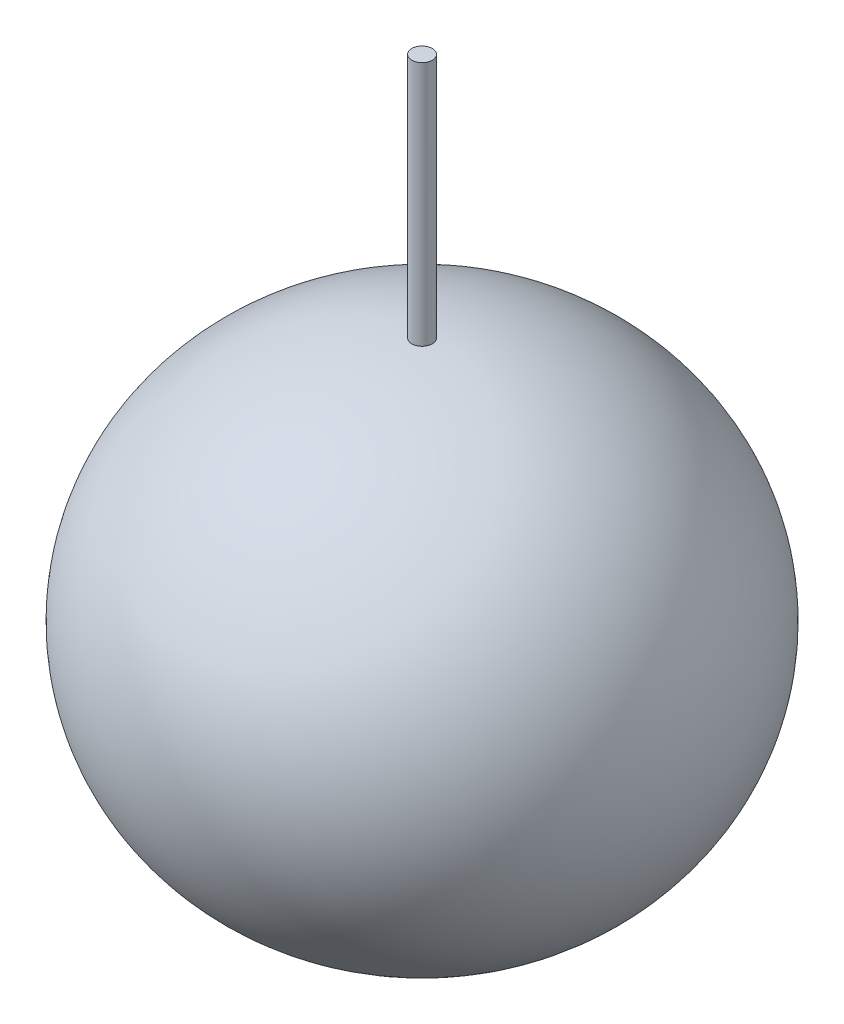
ISO-10303-21;
HEADER;
FILE_DESCRIPTION(('STEP AP214'),'2;1');
FILE_NAME('part.step','',(''),(''),'','','');
FILE_SCHEMA(('AUTOMOTIVE_DESIGN { 1 0 10303 214 1 1 1 1 }'));
ENDSEC;
DATA;
#1=APPLICATION_CONTEXT('core data for automotive mechanical design processes');
#2=APPLICATION_PROTOCOL_DEFINITION('international standard','automotive_design',2000,#1);
#3=PRODUCT_CONTEXT('',#1,'mechanical');
#4=PRODUCT('Part','Part','',(#3));
#5=PRODUCT_RELATED_PRODUCT_CATEGORY('part','',(#4));
#6=PRODUCT_DEFINITION_FORMATION('','',#4);
#7=PRODUCT_DEFINITION_CONTEXT('part definition',#1,'design');
#8=PRODUCT_DEFINITION('design','',#6,#7);
#9=PRODUCT_DEFINITION_SHAPE('','',#8);
#10=(LENGTH_UNIT() NAMED_UNIT(*) SI_UNIT(.MILLI.,.METRE.));
#11=(NAMED_UNIT(*) PLANE_ANGLE_UNIT() SI_UNIT($,.RADIAN.));
#12=(NAMED_UNIT(*) SI_UNIT($,.STERADIAN.) SOLID_ANGLE_UNIT());
#13=UNCERTAINTY_MEASURE_WITH_UNIT(LENGTH_MEASURE(1.E-05),#10,'distance_accuracy_value','');
#14=(GEOMETRIC_REPRESENTATION_CONTEXT(3) GLOBAL_UNCERTAINTY_ASSIGNED_CONTEXT((#13)) GLOBAL_UNIT_ASSIGNED_CONTEXT((#10,
#11,#12)) REPRESENTATION_CONTEXT('',''));
#15=CARTESIAN_POINT('',(0.,0.,0.));
#16=DIRECTION('',(0.,0.,1.));
#17=DIRECTION('',(1.,0.,0.));
#18=AXIS2_PLACEMENT_3D('',#15,#16,#17);
#19=CARTESIAN_POINT('',(0.,0.,0.));
#20=DIRECTION('',(0.,0.,1.));
#21=DIRECTION('',(-1.,0.,0.));
#22=AXIS2_PLACEMENT_3D('',#19,#20,#21);
#23=ELLIPSE('',#22,32.5,30.);
#24=TRIMMED_CURVE('',#23,(PARAMETER_VALUE(1.5707963267949)),(PARAMETER_VALUE(4.71238898038469)),
.T.,.PARAMETER.);
#25=CARTESIAN_POINT('',(0.,30.,0.));
#26=DIRECTION('',(0.,1.,0.));
#27=AXIS1_PLACEMENT('',#25,#26);
#28=SURFACE_OF_REVOLUTION('',#24,#27);
#29=CARTESIAN_POINT('',(0.,-30.,0.));
#30=VERTEX_POINT('',#29);
#31=VERTEX_LOOP('',#30);
#32=FACE_BOUND('',#31,.T.);
#33=CARTESIAN_POINT('',(0.,29.9778024386921,0.));
#34=DIRECTION('',(0.,1.,0.));
#35=DIRECTION('',(0.,0.,1.));
#36=AXIS2_PLACEMENT_3D('',#33,#34,#35);
#37=CIRCLE('',#36,1.25);
#38=CARTESIAN_POINT('',(0.,29.9778024386921,1.25));
#39=VERTEX_POINT('',#38);
#40=EDGE_CURVE('E11',#39,#39,#37,.T.);
#41=ORIENTED_EDGE('',*,*,#40,.F.);
#42=EDGE_LOOP('',(#41));
#43=FACE_BOUND('',#42,.T.);
#44=ADVANCED_FACE('F39',(#32,#43),#28,.T.);
#45=CARTESIAN_POINT('',(0.,60.,0.));
#46=DIRECTION('',(0.,-1.,0.));
#47=DIRECTION('',(0.,0.,-1.));
#48=AXIS2_PLACEMENT_3D('',#45,#46,#47);
#49=CYLINDRICAL_SURFACE('',#48,1.25);
#50=CARTESIAN_POINT('',(0.,60.,0.));
#51=DIRECTION('',(0.,1.,0.));
#52=DIRECTION('',(0.,0.,1.));
#53=AXIS2_PLACEMENT_3D('',#50,#51,#52);
#54=CIRCLE('',#53,1.25);
#55=CARTESIAN_POINT('',(0.,60.,1.25));
#56=VERTEX_POINT('',#55);
#57=EDGE_CURVE('E45',#56,#56,#54,.T.);
#58=ORIENTED_EDGE('',*,*,#57,.F.);
#59=EDGE_LOOP('',(#58));
#60=FACE_BOUND('',#59,.T.);
#61=ORIENTED_EDGE('',*,*,#40,.T.);
#62=EDGE_LOOP('',(#61));
#63=FACE_BOUND('',#62,.T.);
#64=ADVANCED_FACE('F50',(#60,#63),#49,.T.);
#65=CARTESIAN_POINT('',(0.,60.,0.));
#66=DIRECTION('',(0.,1.,0.));
#67=DIRECTION('',(0.,0.,1.));
#68=AXIS2_PLACEMENT_3D('',#65,#66,#67);
#69=PLANE('',#68);
#70=ORIENTED_EDGE('',*,*,#57,.T.);
#71=EDGE_LOOP('',(#70));
#72=FACE_BOUND('',#71,.T.);
#73=ADVANCED_FACE('F54',(#72),#69,.T.);
#74=CLOSED_SHELL('',(#44,#64,#73));
#75=MANIFOLD_SOLID_BREP('B2',#74);
#76=ADVANCED_BREP_SHAPE_REPRESENTATION('',(#18,#75),#14);
#77=SHAPE_DEFINITION_REPRESENTATION(#9,#76);
ENDSEC;
END-ISO-10303-21;
